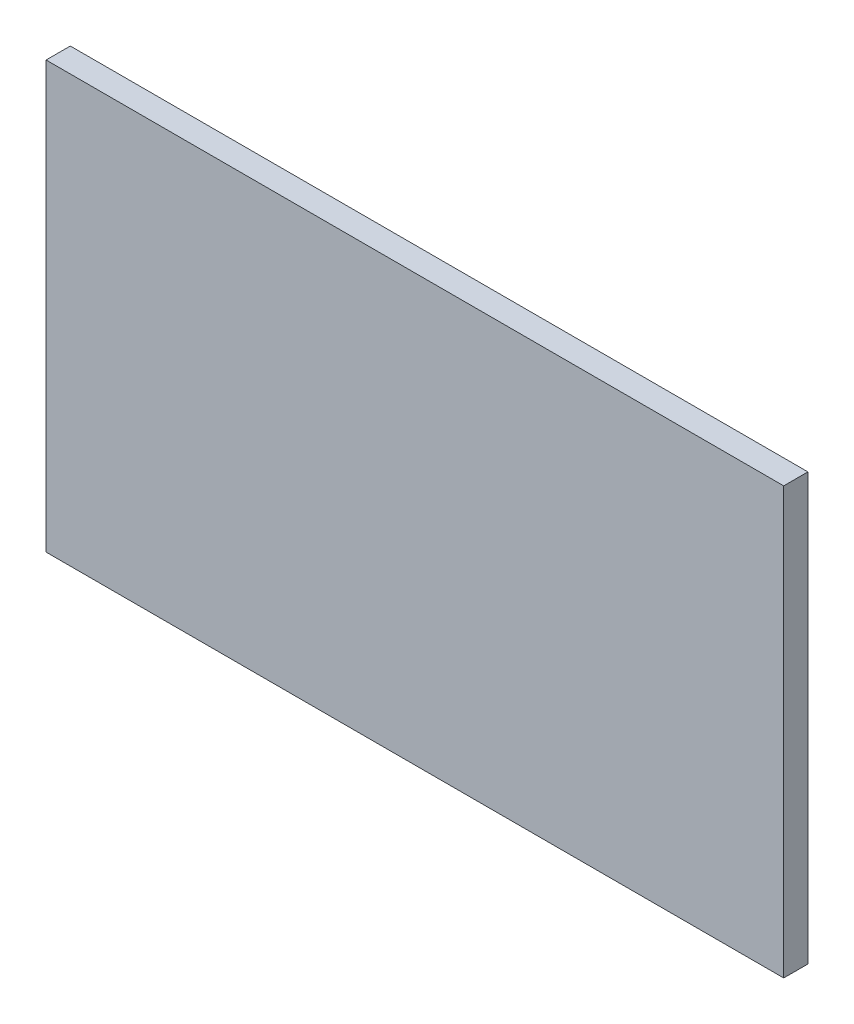
ISO-10303-21;
HEADER;
FILE_DESCRIPTION(('STEP AP214'),'2;1');
FILE_NAME('part.step','',(''),(''),'','','');
FILE_SCHEMA(('AUTOMOTIVE_DESIGN { 1 0 10303 214 1 1 1 1 }'));
ENDSEC;
DATA;
#1=APPLICATION_CONTEXT('core data for automotive mechanical design processes');
#2=APPLICATION_PROTOCOL_DEFINITION('international standard','automotive_design',2000,#1);
#3=PRODUCT_CONTEXT('',#1,'mechanical');
#4=PRODUCT('Part','Part','',(#3));
#5=PRODUCT_RELATED_PRODUCT_CATEGORY('part','',(#4));
#6=PRODUCT_DEFINITION_FORMATION('','',#4);
#7=PRODUCT_DEFINITION_CONTEXT('part definition',#1,'design');
#8=PRODUCT_DEFINITION('design','',#6,#7);
#9=PRODUCT_DEFINITION_SHAPE('','',#8);
#10=(LENGTH_UNIT() NAMED_UNIT(*) SI_UNIT(.MILLI.,.METRE.));
#11=(NAMED_UNIT(*) PLANE_ANGLE_UNIT() SI_UNIT($,.RADIAN.));
#12=(NAMED_UNIT(*) SI_UNIT($,.STERADIAN.) SOLID_ANGLE_UNIT());
#13=UNCERTAINTY_MEASURE_WITH_UNIT(LENGTH_MEASURE(1.E-05),#10,'distance_accuracy_value','');
#14=(GEOMETRIC_REPRESENTATION_CONTEXT(3) GLOBAL_UNCERTAINTY_ASSIGNED_CONTEXT((#13)) GLOBAL_UNIT_ASSIGNED_CONTEXT((#10,
#11,#12)) REPRESENTATION_CONTEXT('',''));
#15=CARTESIAN_POINT('',(0.,0.,0.));
#16=DIRECTION('',(0.,0.,1.));
#17=DIRECTION('',(1.,0.,0.));
#18=AXIS2_PLACEMENT_3D('',#15,#16,#17);
#19=CARTESIAN_POINT('',(0.,0.,6.35));
#20=DIRECTION('',(1.,0.,0.));
#21=DIRECTION('',(0.,0.,-1.));
#22=AXIS2_PLACEMENT_3D('',#19,#20,#21);
#23=PLANE('',#22);
#24=DIRECTION('',(0.,-1.,0.));
#25=VECTOR('',#24,1.);
#26=CARTESIAN_POINT('',(0.,0.,0.));
#27=LINE('',#26,#25);
#28=CARTESIAN_POINT('',(0.,111.8,0.));
#29=VERTEX_POINT('',#28);
#30=CARTESIAN_POINT('',(0.,0.,0.));
#31=VERTEX_POINT('',#30);
#32=EDGE_CURVE('E99',#29,#31,#27,.T.);
#33=ORIENTED_EDGE('',*,*,#32,.T.);
#34=DIRECTION('',(0.,0.,-1.));
#35=VECTOR('',#34,1.);
#36=CARTESIAN_POINT('',(0.,0.,6.35));
#37=LINE('',#36,#35);
#38=CARTESIAN_POINT('',(0.,0.,6.35));
#39=VERTEX_POINT('',#38);
#40=EDGE_CURVE('E11',#39,#31,#37,.T.);
#41=ORIENTED_EDGE('',*,*,#40,.F.);
#42=DIRECTION('',(0.,-1.,0.));
#43=VECTOR('',#42,1.);
#44=CARTESIAN_POINT('',(0.,0.,6.35));
#45=LINE('',#44,#43);
#46=CARTESIAN_POINT('',(0.,111.8,6.35));
#47=VERTEX_POINT('',#46);
#48=EDGE_CURVE('E87',#47,#39,#45,.T.);
#49=ORIENTED_EDGE('',*,*,#48,.F.);
#50=DIRECTION('',(0.,0.,-1.));
#51=VECTOR('',#50,1.);
#52=CARTESIAN_POINT('',(0.,111.8,6.35));
#53=LINE('',#52,#51);
#54=EDGE_CURVE('E95',#47,#29,#53,.T.);
#55=ORIENTED_EDGE('',*,*,#54,.T.);
#56=EDGE_LOOP('',(#33,#41,#49,#55));
#57=FACE_BOUND('',#56,.T.);
#58=ADVANCED_FACE('F36',(#57),#23,.F.);
#59=CARTESIAN_POINT('',(0.,0.,6.35));
#60=DIRECTION('',(0.,1.,0.));
#61=DIRECTION('',(0.,0.,1.));
#62=AXIS2_PLACEMENT_3D('',#59,#60,#61);
#63=PLANE('',#62);
#64=DIRECTION('',(1.,0.,0.));
#65=VECTOR('',#64,1.);
#66=CARTESIAN_POINT('',(0.,0.,0.));
#67=LINE('',#66,#65);
#68=CARTESIAN_POINT('',(193.49,0.,0.));
#69=VERTEX_POINT('',#68);
#70=EDGE_CURVE('E91',#31,#69,#67,.T.);
#71=ORIENTED_EDGE('',*,*,#70,.T.);
#72=DIRECTION('',(0.,0.,-1.));
#73=VECTOR('',#72,1.);
#74=CARTESIAN_POINT('',(193.49,0.,6.35));
#75=LINE('',#74,#73);
#76=CARTESIAN_POINT('',(193.49,0.,6.35));
#77=VERTEX_POINT('',#76);
#78=EDGE_CURVE('E44',#77,#69,#75,.T.);
#79=ORIENTED_EDGE('',*,*,#78,.F.);
#80=DIRECTION('',(1.,0.,0.));
#81=VECTOR('',#80,1.);
#82=CARTESIAN_POINT('',(0.,0.,6.35));
#83=LINE('',#82,#81);
#84=EDGE_CURVE('E82',#39,#77,#83,.T.);
#85=ORIENTED_EDGE('',*,*,#84,.F.);
#86=ORIENTED_EDGE('',*,*,#40,.T.);
#87=EDGE_LOOP('',(#71,#79,#85,#86));
#88=FACE_BOUND('',#87,.T.);
#89=ADVANCED_FACE('F90',(#88),#63,.F.);
#90=CARTESIAN_POINT('',(193.49,0.,6.35));
#91=DIRECTION('',(-1.,0.,0.));
#92=DIRECTION('',(0.,0.,1.));
#93=AXIS2_PLACEMENT_3D('',#90,#91,#92);
#94=PLANE('',#93);
#95=DIRECTION('',(0.,1.,0.));
#96=VECTOR('',#95,1.);
#97=CARTESIAN_POINT('',(193.49,0.,0.));
#98=LINE('',#97,#96);
#99=CARTESIAN_POINT('',(193.49,111.8,0.));
#100=VERTEX_POINT('',#99);
#101=EDGE_CURVE('E69',#69,#100,#98,.T.);
#102=ORIENTED_EDGE('',*,*,#101,.T.);
#103=DIRECTION('',(0.,0.,-1.));
#104=VECTOR('',#103,1.);
#105=CARTESIAN_POINT('',(193.49,111.8,6.35));
#106=LINE('',#105,#104);
#107=CARTESIAN_POINT('',(193.49,111.8,6.35));
#108=VERTEX_POINT('',#107);
#109=EDGE_CURVE('E92',#108,#100,#106,.T.);
#110=ORIENTED_EDGE('',*,*,#109,.F.);
#111=DIRECTION('',(0.,1.,0.));
#112=VECTOR('',#111,1.);
#113=CARTESIAN_POINT('',(193.49,0.,6.35));
#114=LINE('',#113,#112);
#115=EDGE_CURVE('E85',#77,#108,#114,.T.);
#116=ORIENTED_EDGE('',*,*,#115,.F.);
#117=ORIENTED_EDGE('',*,*,#78,.T.);
#118=EDGE_LOOP('',(#102,#110,#116,#117));
#119=FACE_BOUND('',#118,.T.);
#120=ADVANCED_FACE('F93',(#119),#94,.F.);
#121=CARTESIAN_POINT('',(0.,111.8,6.35));
#122=DIRECTION('',(0.,-1.,0.));
#123=DIRECTION('',(0.,0.,-1.));
#124=AXIS2_PLACEMENT_3D('',#121,#122,#123);
#125=PLANE('',#124);
#126=DIRECTION('',(-1.,0.,0.));
#127=VECTOR('',#126,1.);
#128=CARTESIAN_POINT('',(0.,111.8,0.));
#129=LINE('',#128,#127);
#130=EDGE_CURVE('E75',#100,#29,#129,.T.);
#131=ORIENTED_EDGE('',*,*,#130,.T.);
#132=ORIENTED_EDGE('',*,*,#54,.F.);
#133=DIRECTION('',(-1.,0.,0.));
#134=VECTOR('',#133,1.);
#135=CARTESIAN_POINT('',(0.,111.8,6.35));
#136=LINE('',#135,#134);
#137=EDGE_CURVE('E52',#108,#47,#136,.T.);
#138=ORIENTED_EDGE('',*,*,#137,.F.);
#139=ORIENTED_EDGE('',*,*,#109,.T.);
#140=EDGE_LOOP('',(#131,#132,#138,#139));
#141=FACE_BOUND('',#140,.T.);
#142=ADVANCED_FACE('F106',(#141),#125,.F.);
#143=CARTESIAN_POINT('',(0.,0.,6.35));
#144=DIRECTION('',(0.,0.,-1.));
#145=DIRECTION('',(-1.,0.,0.));
#146=AXIS2_PLACEMENT_3D('',#143,#144,#145);
#147=PLANE('',#146);
#148=ORIENTED_EDGE('',*,*,#48,.T.);
#149=ORIENTED_EDGE('',*,*,#84,.T.);
#150=ORIENTED_EDGE('',*,*,#115,.T.);
#151=ORIENTED_EDGE('',*,*,#137,.T.);
#152=EDGE_LOOP('',(#148,#149,#150,#151));
#153=FACE_BOUND('',#152,.T.);
#154=ADVANCED_FACE('F83',(#153),#147,.F.);
#155=CARTESIAN_POINT('',(0.,0.,0.));
#156=DIRECTION('',(0.,0.,-1.));
#157=DIRECTION('',(-1.,0.,0.));
#158=AXIS2_PLACEMENT_3D('',#155,#156,#157);
#159=PLANE('',#158);
#160=ORIENTED_EDGE('',*,*,#32,.F.);
#161=ORIENTED_EDGE('',*,*,#130,.F.);
#162=ORIENTED_EDGE('',*,*,#101,.F.);
#163=ORIENTED_EDGE('',*,*,#70,.F.);
#164=EDGE_LOOP('',(#160,#161,#162,#163));
#165=FACE_BOUND('',#164,.T.);
#166=ADVANCED_FACE('F109',(#165),#159,.T.);
#167=CLOSED_SHELL('',(#58,#89,#120,#142,#154,#166));
#168=MANIFOLD_SOLID_BREP('B2',#167);
#169=ADVANCED_BREP_SHAPE_REPRESENTATION('',(#18,#168),#14);
#170=SHAPE_DEFINITION_REPRESENTATION(#9,#169);
ENDSEC;
END-ISO-10303-21;
